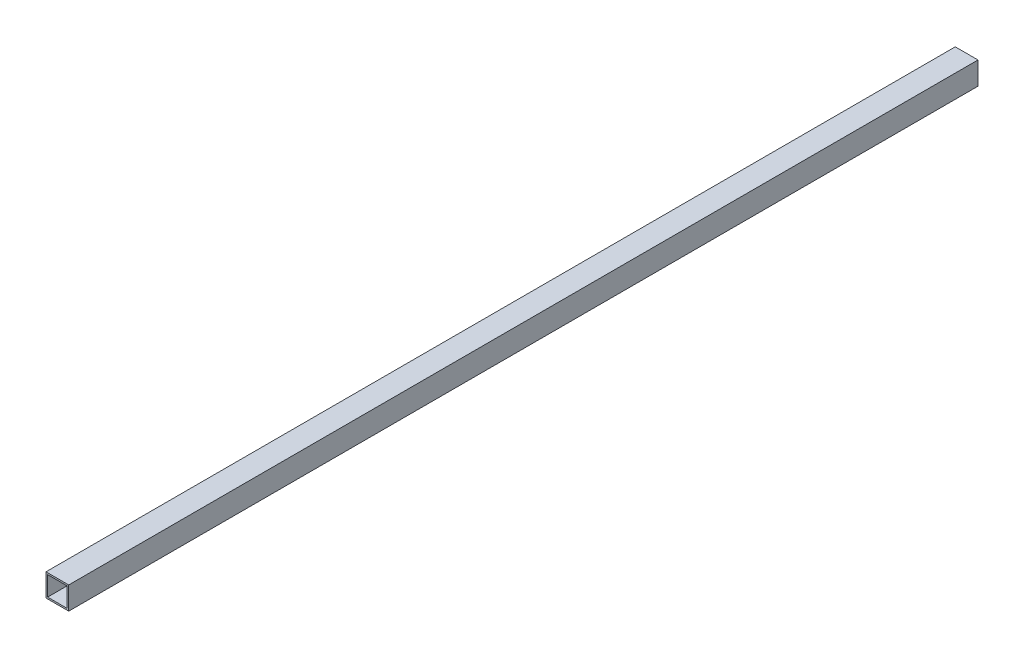
ISO-10303-21;
HEADER;
FILE_DESCRIPTION(('STEP AP214'),'2;1');
FILE_NAME('part.step','',(''),(''),'','','');
FILE_SCHEMA(('AUTOMOTIVE_DESIGN { 1 0 10303 214 1 1 1 1 }'));
ENDSEC;
DATA;
#1=APPLICATION_CONTEXT('core data for automotive mechanical design processes');
#2=APPLICATION_PROTOCOL_DEFINITION('international standard','automotive_design',2000,#1);
#3=PRODUCT_CONTEXT('',#1,'mechanical');
#4=PRODUCT('Part','Part','',(#3));
#5=PRODUCT_RELATED_PRODUCT_CATEGORY('part','',(#4));
#6=PRODUCT_DEFINITION_FORMATION('','',#4);
#7=PRODUCT_DEFINITION_CONTEXT('part definition',#1,'design');
#8=PRODUCT_DEFINITION('design','',#6,#7);
#9=PRODUCT_DEFINITION_SHAPE('','',#8);
#10=(LENGTH_UNIT() NAMED_UNIT(*) SI_UNIT(.MILLI.,.METRE.));
#11=(NAMED_UNIT(*) PLANE_ANGLE_UNIT() SI_UNIT($,.RADIAN.));
#12=(NAMED_UNIT(*) SI_UNIT($,.STERADIAN.) SOLID_ANGLE_UNIT());
#13=UNCERTAINTY_MEASURE_WITH_UNIT(LENGTH_MEASURE(1.E-05),#10,'distance_accuracy_value','');
#14=(GEOMETRIC_REPRESENTATION_CONTEXT(3) GLOBAL_UNCERTAINTY_ASSIGNED_CONTEXT((#13)) GLOBAL_UNIT_ASSIGNED_CONTEXT((#10,
#11,#12)) REPRESENTATION_CONTEXT('',''));
#15=CARTESIAN_POINT('',(0.,0.,0.));
#16=DIRECTION('',(0.,0.,1.));
#17=DIRECTION('',(1.,0.,0.));
#18=AXIS2_PLACEMENT_3D('',#15,#16,#17);
#19=CARTESIAN_POINT('',(0.,0.,1778.));
#20=DIRECTION('',(0.,0.,-1.));
#21=DIRECTION('',(-1.,0.,0.));
#22=AXIS2_PLACEMENT_3D('',#19,#20,#21);
#23=PLANE('',#22);
#24=DIRECTION('',(0.,-1.,0.));
#25=VECTOR('',#24,1.);
#26=CARTESIAN_POINT('',(0.,0.,1778.));
#27=LINE('',#26,#25);
#28=CARTESIAN_POINT('',(0.,44.45,1778.));
#29=VERTEX_POINT('',#28);
#30=CARTESIAN_POINT('',(0.,0.,1778.));
#31=VERTEX_POINT('',#30);
#32=EDGE_CURVE('E135',#29,#31,#27,.T.);
#33=ORIENTED_EDGE('',*,*,#32,.T.);
#34=DIRECTION('',(1.,0.,0.));
#35=VECTOR('',#34,1.);
#36=CARTESIAN_POINT('',(0.,0.,1778.));
#37=LINE('',#36,#35);
#38=CARTESIAN_POINT('',(44.45,0.,1778.));
#39=VERTEX_POINT('',#38);
#40=EDGE_CURVE('E138',#31,#39,#37,.T.);
#41=ORIENTED_EDGE('',*,*,#40,.T.);
#42=DIRECTION('',(0.,1.,0.));
#43=VECTOR('',#42,1.);
#44=CARTESIAN_POINT('',(44.45,0.,1778.));
#45=LINE('',#44,#43);
#46=CARTESIAN_POINT('',(44.45,44.45,1778.));
#47=VERTEX_POINT('',#46);
#48=EDGE_CURVE('E141',#39,#47,#45,.T.);
#49=ORIENTED_EDGE('',*,*,#48,.T.);
#50=DIRECTION('',(-1.,0.,0.));
#51=VECTOR('',#50,1.);
#52=CARTESIAN_POINT('',(0.,44.45,1778.));
#53=LINE('',#52,#51);
#54=EDGE_CURVE('E143',#47,#29,#53,.T.);
#55=ORIENTED_EDGE('',*,*,#54,.T.);
#56=EDGE_LOOP('',(#33,#41,#49,#55));
#57=FACE_BOUND('',#56,.T.);
#58=DIRECTION('',(0.,-1.,0.));
#59=VECTOR('',#58,1.);
#60=CARTESIAN_POINT('',(3.175,3.175,1778.));
#61=LINE('',#60,#59);
#62=CARTESIAN_POINT('',(3.175,41.275,1778.));
#63=VERTEX_POINT('',#62);
#64=CARTESIAN_POINT('',(3.175,3.175,1778.));
#65=VERTEX_POINT('',#64);
#66=EDGE_CURVE('E99',#63,#65,#61,.T.);
#67=ORIENTED_EDGE('',*,*,#66,.F.);
#68=DIRECTION('',(-1.,0.,0.));
#69=VECTOR('',#68,1.);
#70=CARTESIAN_POINT('',(3.175,41.275,1778.));
#71=LINE('',#70,#69);
#72=CARTESIAN_POINT('',(41.275,41.275,1778.));
#73=VERTEX_POINT('',#72);
#74=EDGE_CURVE('E121',#73,#63,#71,.T.);
#75=ORIENTED_EDGE('',*,*,#74,.F.);
#76=DIRECTION('',(0.,1.,0.));
#77=VECTOR('',#76,1.);
#78=CARTESIAN_POINT('',(41.275,3.175,1778.));
#79=LINE('',#78,#77);
#80=CARTESIAN_POINT('',(41.275,3.175,1778.));
#81=VERTEX_POINT('',#80);
#82=EDGE_CURVE('E119',#81,#73,#79,.T.);
#83=ORIENTED_EDGE('',*,*,#82,.F.);
#84=DIRECTION('',(1.,0.,0.));
#85=VECTOR('',#84,1.);
#86=CARTESIAN_POINT('',(3.175,3.175,1778.));
#87=LINE('',#86,#85);
#88=EDGE_CURVE('E107',#65,#81,#87,.T.);
#89=ORIENTED_EDGE('',*,*,#88,.F.);
#90=EDGE_LOOP('',(#67,#75,#83,#89));
#91=FACE_BOUND('',#90,.T.);
#92=ADVANCED_FACE('F34',(#57,#91),#23,.F.);
#93=CARTESIAN_POINT('',(0.,0.,0.));
#94=DIRECTION('',(0.,0.,-1.));
#95=DIRECTION('',(-1.,0.,0.));
#96=AXIS2_PLACEMENT_3D('',#93,#94,#95);
#97=PLANE('',#96);
#98=DIRECTION('',(0.,-1.,0.));
#99=VECTOR('',#98,1.);
#100=CARTESIAN_POINT('',(0.,0.,0.));
#101=LINE('',#100,#99);
#102=CARTESIAN_POINT('',(0.,44.45,0.));
#103=VERTEX_POINT('',#102);
#104=CARTESIAN_POINT('',(0.,0.,0.));
#105=VERTEX_POINT('',#104);
#106=EDGE_CURVE('E115',#103,#105,#101,.T.);
#107=ORIENTED_EDGE('',*,*,#106,.F.);
#108=DIRECTION('',(-1.,0.,0.));
#109=VECTOR('',#108,1.);
#110=CARTESIAN_POINT('',(0.,44.45,0.));
#111=LINE('',#110,#109);
#112=CARTESIAN_POINT('',(44.45,44.45,0.));
#113=VERTEX_POINT('',#112);
#114=EDGE_CURVE('E139',#113,#103,#111,.T.);
#115=ORIENTED_EDGE('',*,*,#114,.F.);
#116=DIRECTION('',(0.,1.,0.));
#117=VECTOR('',#116,1.);
#118=CARTESIAN_POINT('',(44.45,0.,0.));
#119=LINE('',#118,#117);
#120=CARTESIAN_POINT('',(44.45,0.,0.));
#121=VERTEX_POINT('',#120);
#122=EDGE_CURVE('E150',#121,#113,#119,.T.);
#123=ORIENTED_EDGE('',*,*,#122,.F.);
#124=DIRECTION('',(1.,0.,0.));
#125=VECTOR('',#124,1.);
#126=CARTESIAN_POINT('',(0.,0.,0.));
#127=LINE('',#126,#125);
#128=EDGE_CURVE('E148',#105,#121,#127,.T.);
#129=ORIENTED_EDGE('',*,*,#128,.F.);
#130=EDGE_LOOP('',(#107,#115,#123,#129));
#131=FACE_BOUND('',#130,.T.);
#132=DIRECTION('',(-1.,0.,0.));
#133=VECTOR('',#132,1.);
#134=CARTESIAN_POINT('',(3.175,41.275,0.));
#135=LINE('',#134,#133);
#136=CARTESIAN_POINT('',(41.275,41.275,0.));
#137=VERTEX_POINT('',#136);
#138=CARTESIAN_POINT('',(3.175,41.275,0.));
#139=VERTEX_POINT('',#138);
#140=EDGE_CURVE('E108',#137,#139,#135,.T.);
#141=ORIENTED_EDGE('',*,*,#140,.T.);
#142=DIRECTION('',(0.,-1.,0.));
#143=VECTOR('',#142,1.);
#144=CARTESIAN_POINT('',(3.175,3.175,0.));
#145=LINE('',#144,#143);
#146=CARTESIAN_POINT('',(3.175,3.175,0.));
#147=VERTEX_POINT('',#146);
#148=EDGE_CURVE('E57',#139,#147,#145,.T.);
#149=ORIENTED_EDGE('',*,*,#148,.T.);
#150=DIRECTION('',(1.,0.,0.));
#151=VECTOR('',#150,1.);
#152=CARTESIAN_POINT('',(3.175,3.175,0.));
#153=LINE('',#152,#151);
#154=CARTESIAN_POINT('',(41.275,3.175,0.));
#155=VERTEX_POINT('',#154);
#156=EDGE_CURVE('E114',#147,#155,#153,.T.);
#157=ORIENTED_EDGE('',*,*,#156,.T.);
#158=DIRECTION('',(0.,1.,0.));
#159=VECTOR('',#158,1.);
#160=CARTESIAN_POINT('',(41.275,3.175,0.));
#161=LINE('',#160,#159);
#162=EDGE_CURVE('E127',#155,#137,#161,.T.);
#163=ORIENTED_EDGE('',*,*,#162,.T.);
#164=EDGE_LOOP('',(#141,#149,#157,#163));
#165=FACE_BOUND('',#164,.T.);
#166=ADVANCED_FACE('F168',(#131,#165),#97,.T.);
#167=CARTESIAN_POINT('',(0.,0.,1778.));
#168=DIRECTION('',(1.,0.,0.));
#169=DIRECTION('',(0.,0.,-1.));
#170=AXIS2_PLACEMENT_3D('',#167,#168,#169);
#171=PLANE('',#170);
#172=ORIENTED_EDGE('',*,*,#106,.T.);
#173=DIRECTION('',(0.,0.,-1.));
#174=VECTOR('',#173,1.);
#175=CARTESIAN_POINT('',(0.,0.,1778.));
#176=LINE('',#175,#174);
#177=EDGE_CURVE('E11',#31,#105,#176,.T.);
#178=ORIENTED_EDGE('',*,*,#177,.F.);
#179=ORIENTED_EDGE('',*,*,#32,.F.);
#180=DIRECTION('',(0.,0.,-1.));
#181=VECTOR('',#180,1.);
#182=CARTESIAN_POINT('',(0.,44.45,1778.));
#183=LINE('',#182,#181);
#184=EDGE_CURVE('E145',#29,#103,#183,.T.);
#185=ORIENTED_EDGE('',*,*,#184,.T.);
#186=EDGE_LOOP('',(#172,#178,#179,#185));
#187=FACE_BOUND('',#186,.T.);
#188=ADVANCED_FACE('F36',(#187),#171,.F.);
#189=CARTESIAN_POINT('',(0.,0.,1778.));
#190=DIRECTION('',(0.,1.,0.));
#191=DIRECTION('',(0.,0.,1.));
#192=AXIS2_PLACEMENT_3D('',#189,#190,#191);
#193=PLANE('',#192);
#194=ORIENTED_EDGE('',*,*,#128,.T.);
#195=DIRECTION('',(0.,0.,-1.));
#196=VECTOR('',#195,1.);
#197=CARTESIAN_POINT('',(44.45,0.,1778.));
#198=LINE('',#197,#196);
#199=EDGE_CURVE('E42',#39,#121,#198,.T.);
#200=ORIENTED_EDGE('',*,*,#199,.F.);
#201=ORIENTED_EDGE('',*,*,#40,.F.);
#202=ORIENTED_EDGE('',*,*,#177,.T.);
#203=EDGE_LOOP('',(#194,#200,#201,#202));
#204=FACE_BOUND('',#203,.T.);
#205=ADVANCED_FACE('F178',(#204),#193,.F.);
#206=CARTESIAN_POINT('',(44.45,0.,1778.));
#207=DIRECTION('',(-1.,0.,0.));
#208=DIRECTION('',(0.,0.,1.));
#209=AXIS2_PLACEMENT_3D('',#206,#207,#208);
#210=PLANE('',#209);
#211=ORIENTED_EDGE('',*,*,#122,.T.);
#212=DIRECTION('',(0.,0.,-1.));
#213=VECTOR('',#212,1.);
#214=CARTESIAN_POINT('',(44.45,44.45,1778.));
#215=LINE('',#214,#213);
#216=EDGE_CURVE('E155',#47,#113,#215,.T.);
#217=ORIENTED_EDGE('',*,*,#216,.F.);
#218=ORIENTED_EDGE('',*,*,#48,.F.);
#219=ORIENTED_EDGE('',*,*,#199,.T.);
#220=EDGE_LOOP('',(#211,#217,#218,#219));
#221=FACE_BOUND('',#220,.T.);
#222=ADVANCED_FACE('F162',(#221),#210,.F.);
#223=CARTESIAN_POINT('',(0.,44.45,1778.));
#224=DIRECTION('',(0.,-1.,0.));
#225=DIRECTION('',(0.,0.,-1.));
#226=AXIS2_PLACEMENT_3D('',#223,#224,#225);
#227=PLANE('',#226);
#228=ORIENTED_EDGE('',*,*,#114,.T.);
#229=ORIENTED_EDGE('',*,*,#184,.F.);
#230=ORIENTED_EDGE('',*,*,#54,.F.);
#231=ORIENTED_EDGE('',*,*,#216,.T.);
#232=EDGE_LOOP('',(#228,#229,#230,#231));
#233=FACE_BOUND('',#232,.T.);
#234=ADVANCED_FACE('F172',(#233),#227,.F.);
#235=CARTESIAN_POINT('',(3.175,3.175,1778.));
#236=DIRECTION('',(1.,0.,0.));
#237=DIRECTION('',(0.,0.,-1.));
#238=AXIS2_PLACEMENT_3D('',#235,#236,#237);
#239=PLANE('',#238);
#240=ORIENTED_EDGE('',*,*,#148,.F.);
#241=DIRECTION('',(0.,0.,-1.));
#242=VECTOR('',#241,1.);
#243=CARTESIAN_POINT('',(3.175,41.275,1778.));
#244=LINE('',#243,#242);
#245=EDGE_CURVE('E103',#63,#139,#244,.T.);
#246=ORIENTED_EDGE('',*,*,#245,.F.);
#247=ORIENTED_EDGE('',*,*,#66,.T.);
#248=DIRECTION('',(0.,0.,-1.));
#249=VECTOR('',#248,1.);
#250=CARTESIAN_POINT('',(3.175,3.175,1778.));
#251=LINE('',#250,#249);
#252=EDGE_CURVE('E102',#65,#147,#251,.T.);
#253=ORIENTED_EDGE('',*,*,#252,.T.);
#254=EDGE_LOOP('',(#240,#246,#247,#253));
#255=FACE_BOUND('',#254,.T.);
#256=ADVANCED_FACE('F101',(#255),#239,.T.);
#257=CARTESIAN_POINT('',(3.175,3.175,1778.));
#258=DIRECTION('',(0.,1.,0.));
#259=DIRECTION('',(0.,0.,1.));
#260=AXIS2_PLACEMENT_3D('',#257,#258,#259);
#261=PLANE('',#260);
#262=ORIENTED_EDGE('',*,*,#156,.F.);
#263=ORIENTED_EDGE('',*,*,#252,.F.);
#264=ORIENTED_EDGE('',*,*,#88,.T.);
#265=DIRECTION('',(0.,0.,-1.));
#266=VECTOR('',#265,1.);
#267=CARTESIAN_POINT('',(41.275,3.175,1778.));
#268=LINE('',#267,#266);
#269=EDGE_CURVE('E116',#81,#155,#268,.T.);
#270=ORIENTED_EDGE('',*,*,#269,.T.);
#271=EDGE_LOOP('',(#262,#263,#264,#270));
#272=FACE_BOUND('',#271,.T.);
#273=ADVANCED_FACE('F111',(#272),#261,.T.);
#274=CARTESIAN_POINT('',(41.275,3.175,1778.));
#275=DIRECTION('',(-1.,0.,0.));
#276=DIRECTION('',(0.,0.,1.));
#277=AXIS2_PLACEMENT_3D('',#274,#275,#276);
#278=PLANE('',#277);
#279=ORIENTED_EDGE('',*,*,#162,.F.);
#280=ORIENTED_EDGE('',*,*,#269,.F.);
#281=ORIENTED_EDGE('',*,*,#82,.T.);
#282=DIRECTION('',(0.,0.,-1.));
#283=VECTOR('',#282,1.);
#284=CARTESIAN_POINT('',(41.275,41.275,1778.));
#285=LINE('',#284,#283);
#286=EDGE_CURVE('E49',#73,#137,#285,.T.);
#287=ORIENTED_EDGE('',*,*,#286,.T.);
#288=EDGE_LOOP('',(#279,#280,#281,#287));
#289=FACE_BOUND('',#288,.T.);
#290=ADVANCED_FACE('F201',(#289),#278,.T.);
#291=CARTESIAN_POINT('',(3.175,41.275,1778.));
#292=DIRECTION('',(0.,-1.,0.));
#293=DIRECTION('',(0.,0.,-1.));
#294=AXIS2_PLACEMENT_3D('',#291,#292,#293);
#295=PLANE('',#294);
#296=ORIENTED_EDGE('',*,*,#140,.F.);
#297=ORIENTED_EDGE('',*,*,#286,.F.);
#298=ORIENTED_EDGE('',*,*,#74,.T.);
#299=ORIENTED_EDGE('',*,*,#245,.T.);
#300=EDGE_LOOP('',(#296,#297,#298,#299));
#301=FACE_BOUND('',#300,.T.);
#302=ADVANCED_FACE('F205',(#301),#295,.T.);
#303=CLOSED_SHELL('',(#92,#166,#188,#205,#222,#234,#256,#273,#290,#302));
#304=MANIFOLD_SOLID_BREP('B2',#303);
#305=ADVANCED_BREP_SHAPE_REPRESENTATION('',(#18,#304),#14);
#306=SHAPE_DEFINITION_REPRESENTATION(#9,#305);
ENDSEC;
END-ISO-10303-21;
